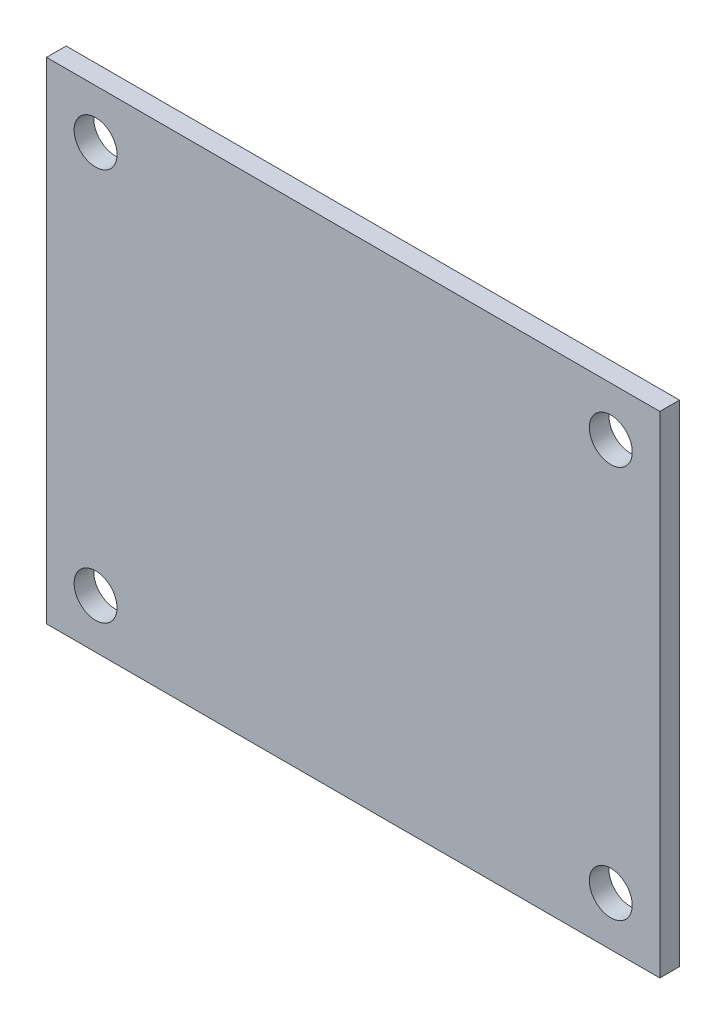
ISO-10303-21;
HEADER;
FILE_DESCRIPTION(('STEP AP214'),'2;1');
FILE_NAME('part.step','',(''),(''),'','','');
FILE_SCHEMA(('AUTOMOTIVE_DESIGN { 1 0 10303 214 1 1 1 1 }'));
ENDSEC;
DATA;
#1=APPLICATION_CONTEXT('core data for automotive mechanical design processes');
#2=APPLICATION_PROTOCOL_DEFINITION('international standard','automotive_design',2000,#1);
#3=PRODUCT_CONTEXT('',#1,'mechanical');
#4=PRODUCT('Part','Part','',(#3));
#5=PRODUCT_RELATED_PRODUCT_CATEGORY('part','',(#4));
#6=PRODUCT_DEFINITION_FORMATION('','',#4);
#7=PRODUCT_DEFINITION_CONTEXT('part definition',#1,'design');
#8=PRODUCT_DEFINITION('design','',#6,#7);
#9=PRODUCT_DEFINITION_SHAPE('','',#8);
#10=(LENGTH_UNIT() NAMED_UNIT(*) SI_UNIT(.MILLI.,.METRE.));
#11=(NAMED_UNIT(*) PLANE_ANGLE_UNIT() SI_UNIT($,.RADIAN.));
#12=(NAMED_UNIT(*) SI_UNIT($,.STERADIAN.) SOLID_ANGLE_UNIT());
#13=UNCERTAINTY_MEASURE_WITH_UNIT(LENGTH_MEASURE(1.E-05),#10,'distance_accuracy_value','');
#14=(GEOMETRIC_REPRESENTATION_CONTEXT(3) GLOBAL_UNCERTAINTY_ASSIGNED_CONTEXT((#13)) GLOBAL_UNIT_ASSIGNED_CONTEXT((#10,
#11,#12)) REPRESENTATION_CONTEXT('',''));
#15=CARTESIAN_POINT('',(0.,0.,0.));
#16=DIRECTION('',(0.,0.,1.));
#17=DIRECTION('',(1.,0.,0.));
#18=AXIS2_PLACEMENT_3D('',#15,#16,#17);
#19=CARTESIAN_POINT('',(0.,0.,1.6));
#20=DIRECTION('',(0.,0.,1.));
#21=DIRECTION('',(1.,0.,0.));
#22=AXIS2_PLACEMENT_3D('',#19,#20,#21);
#23=PLANE('',#22);
#24=CARTESIAN_POINT('',(46.0000096,36.0000042,1.6));
#25=DIRECTION('',(0.,0.,1.));
#26=DIRECTION('',(1.,0.,0.));
#27=AXIS2_PLACEMENT_3D('',#24,#25,#26);
#28=CIRCLE('',#27,1.7500092);
#29=CARTESIAN_POINT('',(47.7500188,36.0000042,1.6));
#30=VERTEX_POINT('',#29);
#31=EDGE_CURVE('E121',#30,#30,#28,.T.);
#32=ORIENTED_EDGE('',*,*,#31,.F.);
#33=EDGE_LOOP('',(#32));
#34=FACE_BOUND('',#33,.T.);
#35=CARTESIAN_POINT('',(4.,4.,1.6));
#36=DIRECTION('',(0.,0.,1.));
#37=DIRECTION('',(1.,0.,0.));
#38=AXIS2_PLACEMENT_3D('',#35,#36,#37);
#39=CIRCLE('',#38,1.7500092);
#40=CARTESIAN_POINT('',(5.7500092,4.,1.6));
#41=VERTEX_POINT('',#40);
#42=EDGE_CURVE('E100',#41,#41,#39,.T.);
#43=ORIENTED_EDGE('',*,*,#42,.F.);
#44=EDGE_LOOP('',(#43));
#45=FACE_BOUND('',#44,.T.);
#46=DIRECTION('',(0.,-1.,0.));
#47=VECTOR('',#46,1.);
#48=CARTESIAN_POINT('',(0.,39.9999962,1.6));
#49=LINE('',#48,#47);
#50=CARTESIAN_POINT('',(0.,39.9999962,1.6));
#51=VERTEX_POINT('',#50);
#52=CARTESIAN_POINT('',(0.,0.,1.6));
#53=VERTEX_POINT('',#52);
#54=EDGE_CURVE('E85',#51,#53,#49,.T.);
#55=ORIENTED_EDGE('',*,*,#54,.T.);
#56=DIRECTION('',(1.,0.,0.));
#57=VECTOR('',#56,1.);
#58=CARTESIAN_POINT('',(0.,0.,1.6));
#59=LINE('',#58,#57);
#60=CARTESIAN_POINT('',(50.0000016,0.,1.6));
#61=VERTEX_POINT('',#60);
#62=EDGE_CURVE('E80',#53,#61,#59,.T.);
#63=ORIENTED_EDGE('',*,*,#62,.T.);
#64=DIRECTION('',(0.,1.,0.));
#65=VECTOR('',#64,1.);
#66=CARTESIAN_POINT('',(50.0000016,0.,1.6));
#67=LINE('',#66,#65);
#68=CARTESIAN_POINT('',(50.0000016,39.9999962,1.6));
#69=VERTEX_POINT('',#68);
#70=EDGE_CURVE('E83',#61,#69,#67,.T.);
#71=ORIENTED_EDGE('',*,*,#70,.T.);
#72=DIRECTION('',(-1.,0.,0.));
#73=VECTOR('',#72,1.);
#74=CARTESIAN_POINT('',(50.0000016,39.9999962,1.6));
#75=LINE('',#74,#73);
#76=EDGE_CURVE('E50',#69,#51,#75,.T.);
#77=ORIENTED_EDGE('',*,*,#76,.T.);
#78=EDGE_LOOP('',(#55,#63,#71,#77));
#79=FACE_BOUND('',#78,.T.);
#80=CARTESIAN_POINT('',(46.0000096,3.999992,1.6));
#81=DIRECTION('',(0.,0.,1.));
#82=DIRECTION('',(1.,0.,0.));
#83=AXIS2_PLACEMENT_3D('',#80,#81,#82);
#84=CIRCLE('',#83,1.7500092);
#85=CARTESIAN_POINT('',(47.7500188,3.999992,1.6));
#86=VERTEX_POINT('',#85);
#87=EDGE_CURVE('E115',#86,#86,#84,.T.);
#88=ORIENTED_EDGE('',*,*,#87,.F.);
#89=EDGE_LOOP('',(#88));
#90=FACE_BOUND('',#89,.T.);
#91=CARTESIAN_POINT('',(3.999992,36.0000042,1.6));
#92=DIRECTION('',(0.,0.,1.));
#93=DIRECTION('',(1.,0.,0.));
#94=AXIS2_PLACEMENT_3D('',#91,#92,#93);
#95=CIRCLE('',#94,1.7500092);
#96=CARTESIAN_POINT('',(5.7500012,36.0000042,1.6));
#97=VERTEX_POINT('',#96);
#98=EDGE_CURVE('E127',#97,#97,#95,.T.);
#99=ORIENTED_EDGE('',*,*,#98,.F.);
#100=EDGE_LOOP('',(#99));
#101=FACE_BOUND('',#100,.T.);
#102=ADVANCED_FACE('F33',(#34,#45,#79,#90,#101),#23,.T.);
#103=CARTESIAN_POINT('',(0.,0.,0.));
#104=DIRECTION('',(0.,0.,1.));
#105=DIRECTION('',(1.,0.,0.));
#106=AXIS2_PLACEMENT_3D('',#103,#104,#105);
#107=PLANE('',#106);
#108=DIRECTION('',(0.,-1.,0.));
#109=VECTOR('',#108,1.);
#110=CARTESIAN_POINT('',(0.,39.9999962,0.));
#111=LINE('',#110,#109);
#112=CARTESIAN_POINT('',(0.,39.9999962,0.));
#113=VERTEX_POINT('',#112);
#114=CARTESIAN_POINT('',(0.,0.,0.));
#115=VERTEX_POINT('',#114);
#116=EDGE_CURVE('E97',#113,#115,#111,.T.);
#117=ORIENTED_EDGE('',*,*,#116,.F.);
#118=DIRECTION('',(-1.,0.,0.));
#119=VECTOR('',#118,1.);
#120=CARTESIAN_POINT('',(50.0000016,39.9999962,0.));
#121=LINE('',#120,#119);
#122=CARTESIAN_POINT('',(50.0000016,39.9999962,0.));
#123=VERTEX_POINT('',#122);
#124=EDGE_CURVE('E73',#123,#113,#121,.T.);
#125=ORIENTED_EDGE('',*,*,#124,.F.);
#126=DIRECTION('',(0.,1.,0.));
#127=VECTOR('',#126,1.);
#128=CARTESIAN_POINT('',(50.0000016,0.,0.));
#129=LINE('',#128,#127);
#130=CARTESIAN_POINT('',(50.0000016,0.,0.));
#131=VERTEX_POINT('',#130);
#132=EDGE_CURVE('E67',#131,#123,#129,.T.);
#133=ORIENTED_EDGE('',*,*,#132,.F.);
#134=DIRECTION('',(1.,0.,0.));
#135=VECTOR('',#134,1.);
#136=CARTESIAN_POINT('',(0.,0.,0.));
#137=LINE('',#136,#135);
#138=EDGE_CURVE('E89',#115,#131,#137,.T.);
#139=ORIENTED_EDGE('',*,*,#138,.F.);
#140=EDGE_LOOP('',(#117,#125,#133,#139));
#141=FACE_BOUND('',#140,.T.);
#142=CARTESIAN_POINT('',(4.,4.,0.));
#143=DIRECTION('',(0.,0.,1.));
#144=DIRECTION('',(1.,0.,0.));
#145=AXIS2_PLACEMENT_3D('',#142,#143,#144);
#146=CIRCLE('',#145,1.7500092);
#147=CARTESIAN_POINT('',(5.7500092,4.,0.));
#148=VERTEX_POINT('',#147);
#149=EDGE_CURVE('E112',#148,#148,#146,.T.);
#150=ORIENTED_EDGE('',*,*,#149,.T.);
#151=EDGE_LOOP('',(#150));
#152=FACE_BOUND('',#151,.T.);
#153=CARTESIAN_POINT('',(46.0000096,3.999992,0.));
#154=DIRECTION('',(0.,0.,1.));
#155=DIRECTION('',(1.,0.,0.));
#156=AXIS2_PLACEMENT_3D('',#153,#154,#155);
#157=CIRCLE('',#156,1.7500092);
#158=CARTESIAN_POINT('',(47.7500188,3.999992,0.));
#159=VERTEX_POINT('',#158);
#160=EDGE_CURVE('E118',#159,#159,#157,.T.);
#161=ORIENTED_EDGE('',*,*,#160,.T.);
#162=EDGE_LOOP('',(#161));
#163=FACE_BOUND('',#162,.T.);
#164=CARTESIAN_POINT('',(46.0000096,36.0000042,0.));
#165=DIRECTION('',(0.,0.,1.));
#166=DIRECTION('',(1.,0.,0.));
#167=AXIS2_PLACEMENT_3D('',#164,#165,#166);
#168=CIRCLE('',#167,1.7500092);
#169=CARTESIAN_POINT('',(47.7500188,36.0000042,0.));
#170=VERTEX_POINT('',#169);
#171=EDGE_CURVE('E124',#170,#170,#168,.T.);
#172=ORIENTED_EDGE('',*,*,#171,.T.);
#173=EDGE_LOOP('',(#172));
#174=FACE_BOUND('',#173,.T.);
#175=CARTESIAN_POINT('',(3.999992,36.0000042,0.));
#176=DIRECTION('',(0.,0.,1.));
#177=DIRECTION('',(1.,0.,0.));
#178=AXIS2_PLACEMENT_3D('',#175,#176,#177);
#179=CIRCLE('',#178,1.7500092);
#180=CARTESIAN_POINT('',(5.7500012,36.0000042,0.));
#181=VERTEX_POINT('',#180);
#182=EDGE_CURVE('E130',#181,#181,#179,.T.);
#183=ORIENTED_EDGE('',*,*,#182,.T.);
#184=EDGE_LOOP('',(#183));
#185=FACE_BOUND('',#184,.T.);
#186=ADVANCED_FACE('F108',(#141,#152,#163,#174,#185),#107,.F.);
#187=CARTESIAN_POINT('',(0.,39.9999962,1.6));
#188=DIRECTION('',(1.,0.,0.));
#189=DIRECTION('',(0.,0.,-1.));
#190=AXIS2_PLACEMENT_3D('',#187,#188,#189);
#191=PLANE('',#190);
#192=ORIENTED_EDGE('',*,*,#116,.T.);
#193=DIRECTION('',(0.,0.,-1.));
#194=VECTOR('',#193,1.);
#195=CARTESIAN_POINT('',(0.,0.,1.6));
#196=LINE('',#195,#194);
#197=EDGE_CURVE('E11',#53,#115,#196,.T.);
#198=ORIENTED_EDGE('',*,*,#197,.F.);
#199=ORIENTED_EDGE('',*,*,#54,.F.);
#200=DIRECTION('',(0.,0.,-1.));
#201=VECTOR('',#200,1.);
#202=CARTESIAN_POINT('',(0.,39.9999962,1.6));
#203=LINE('',#202,#201);
#204=EDGE_CURVE('E93',#51,#113,#203,.T.);
#205=ORIENTED_EDGE('',*,*,#204,.T.);
#206=EDGE_LOOP('',(#192,#198,#199,#205));
#207=FACE_BOUND('',#206,.T.);
#208=ADVANCED_FACE('F35',(#207),#191,.F.);
#209=CARTESIAN_POINT('',(0.,0.,1.6));
#210=DIRECTION('',(0.,1.,0.));
#211=DIRECTION('',(0.,0.,1.));
#212=AXIS2_PLACEMENT_3D('',#209,#210,#211);
#213=PLANE('',#212);
#214=ORIENTED_EDGE('',*,*,#138,.T.);
#215=DIRECTION('',(0.,0.,-1.));
#216=VECTOR('',#215,1.);
#217=CARTESIAN_POINT('',(50.0000016,0.,1.6));
#218=LINE('',#217,#216);
#219=EDGE_CURVE('E42',#61,#131,#218,.T.);
#220=ORIENTED_EDGE('',*,*,#219,.F.);
#221=ORIENTED_EDGE('',*,*,#62,.F.);
#222=ORIENTED_EDGE('',*,*,#197,.T.);
#223=EDGE_LOOP('',(#214,#220,#221,#222));
#224=FACE_BOUND('',#223,.T.);
#225=ADVANCED_FACE('F88',(#224),#213,.F.);
#226=CARTESIAN_POINT('',(50.0000016,0.,1.6));
#227=DIRECTION('',(-1.,0.,0.));
#228=DIRECTION('',(0.,0.,1.));
#229=AXIS2_PLACEMENT_3D('',#226,#227,#228);
#230=PLANE('',#229);
#231=ORIENTED_EDGE('',*,*,#132,.T.);
#232=DIRECTION('',(0.,0.,-1.));
#233=VECTOR('',#232,1.);
#234=CARTESIAN_POINT('',(50.0000016,39.9999962,1.6));
#235=LINE('',#234,#233);
#236=EDGE_CURVE('E90',#69,#123,#235,.T.);
#237=ORIENTED_EDGE('',*,*,#236,.F.);
#238=ORIENTED_EDGE('',*,*,#70,.F.);
#239=ORIENTED_EDGE('',*,*,#219,.T.);
#240=EDGE_LOOP('',(#231,#237,#238,#239));
#241=FACE_BOUND('',#240,.T.);
#242=ADVANCED_FACE('F91',(#241),#230,.F.);
#243=CARTESIAN_POINT('',(50.0000016,39.9999962,1.6));
#244=DIRECTION('',(0.,-1.,0.));
#245=DIRECTION('',(0.,0.,-1.));
#246=AXIS2_PLACEMENT_3D('',#243,#244,#245);
#247=PLANE('',#246);
#248=ORIENTED_EDGE('',*,*,#124,.T.);
#249=ORIENTED_EDGE('',*,*,#204,.F.);
#250=ORIENTED_EDGE('',*,*,#76,.F.);
#251=ORIENTED_EDGE('',*,*,#236,.T.);
#252=EDGE_LOOP('',(#248,#249,#250,#251));
#253=FACE_BOUND('',#252,.T.);
#254=ADVANCED_FACE('F105',(#253),#247,.F.);
#255=CARTESIAN_POINT('',(4.,4.,1.6));
#256=DIRECTION('',(0.,0.,-1.));
#257=DIRECTION('',(-1.,0.,0.));
#258=AXIS2_PLACEMENT_3D('',#255,#256,#257);
#259=CYLINDRICAL_SURFACE('',#258,1.7500092);
#260=ORIENTED_EDGE('',*,*,#42,.T.);
#261=EDGE_LOOP('',(#260));
#262=FACE_BOUND('',#261,.T.);
#263=ORIENTED_EDGE('',*,*,#149,.F.);
#264=EDGE_LOOP('',(#263));
#265=FACE_BOUND('',#264,.T.);
#266=ADVANCED_FACE('F149',(#262,#265),#259,.F.);
#267=CARTESIAN_POINT('',(46.0000096,3.999992,1.6));
#268=DIRECTION('',(0.,0.,-1.));
#269=DIRECTION('',(-1.,0.,0.));
#270=AXIS2_PLACEMENT_3D('',#267,#268,#269);
#271=CYLINDRICAL_SURFACE('',#270,1.7500092);
#272=ORIENTED_EDGE('',*,*,#87,.T.);
#273=EDGE_LOOP('',(#272));
#274=FACE_BOUND('',#273,.T.);
#275=ORIENTED_EDGE('',*,*,#160,.F.);
#276=EDGE_LOOP('',(#275));
#277=FACE_BOUND('',#276,.T.);
#278=ADVANCED_FACE('F195',(#274,#277),#271,.F.);
#279=CARTESIAN_POINT('',(46.0000096,36.0000042,1.6));
#280=DIRECTION('',(0.,0.,-1.));
#281=DIRECTION('',(-1.,0.,0.));
#282=AXIS2_PLACEMENT_3D('',#279,#280,#281);
#283=CYLINDRICAL_SURFACE('',#282,1.7500092);
#284=ORIENTED_EDGE('',*,*,#31,.T.);
#285=EDGE_LOOP('',(#284));
#286=FACE_BOUND('',#285,.T.);
#287=ORIENTED_EDGE('',*,*,#171,.F.);
#288=EDGE_LOOP('',(#287));
#289=FACE_BOUND('',#288,.T.);
#290=ADVANCED_FACE('F203',(#286,#289),#283,.F.);
#291=CARTESIAN_POINT('',(3.999992,36.0000042,1.6));
#292=DIRECTION('',(0.,0.,-1.));
#293=DIRECTION('',(-1.,0.,0.));
#294=AXIS2_PLACEMENT_3D('',#291,#292,#293);
#295=CYLINDRICAL_SURFACE('',#294,1.7500092);
#296=ORIENTED_EDGE('',*,*,#98,.T.);
#297=EDGE_LOOP('',(#296));
#298=FACE_BOUND('',#297,.T.);
#299=ORIENTED_EDGE('',*,*,#182,.F.);
#300=EDGE_LOOP('',(#299));
#301=FACE_BOUND('',#300,.T.);
#302=ADVANCED_FACE('F136',(#298,#301),#295,.F.);
#303=CLOSED_SHELL('',(#102,#186,#208,#225,#242,#254,#266,#278,#290,#302));
#304=MANIFOLD_SOLID_BREP('B2',#303);
#305=ADVANCED_BREP_SHAPE_REPRESENTATION('',(#18,#304),#14);
#306=SHAPE_DEFINITION_REPRESENTATION(#9,#305);
ENDSEC;
END-ISO-10303-21;
